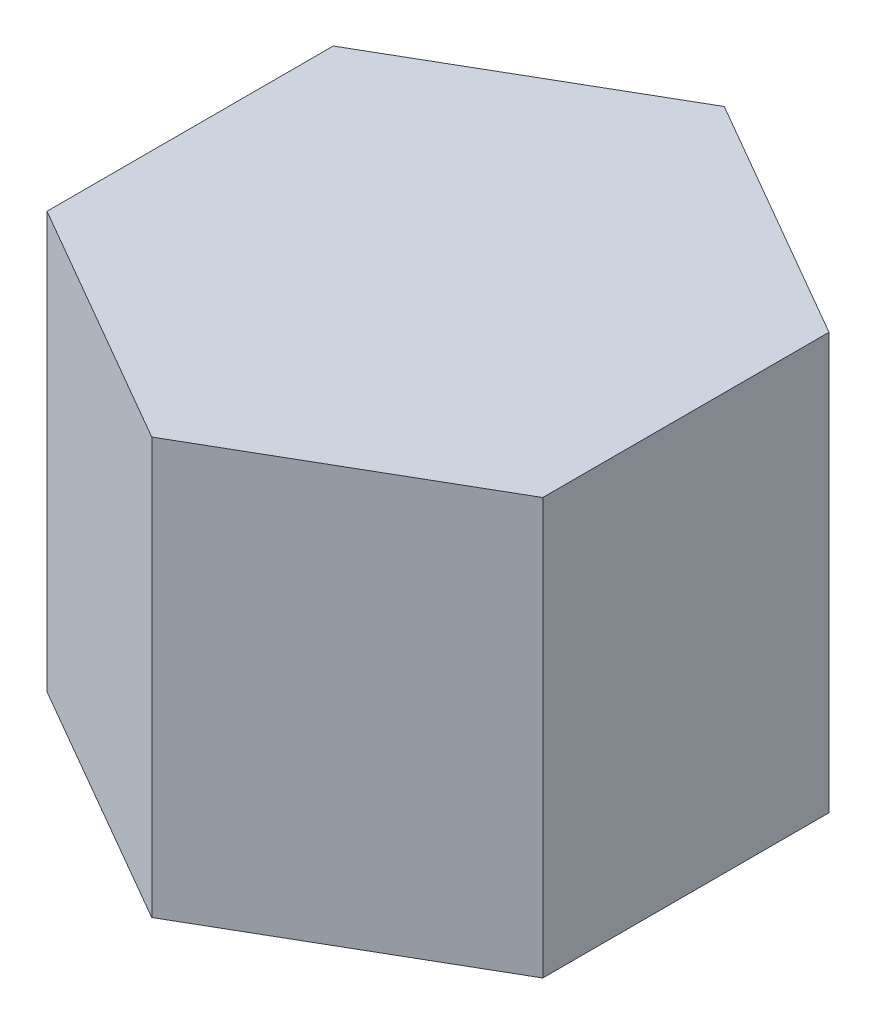
ISO-10303-21;
HEADER;
FILE_DESCRIPTION(('STEP AP214'),'2;1');
FILE_NAME('part.step','',(''),(''),'','','');
FILE_SCHEMA(('AUTOMOTIVE_DESIGN { 1 0 10303 214 1 1 1 1 }'));
ENDSEC;
DATA;
#1=APPLICATION_CONTEXT('core data for automotive mechanical design processes');
#2=APPLICATION_PROTOCOL_DEFINITION('international standard','automotive_design',2000,#1);
#3=PRODUCT_CONTEXT('',#1,'mechanical');
#4=PRODUCT('Part','Part','',(#3));
#5=PRODUCT_RELATED_PRODUCT_CATEGORY('part','',(#4));
#6=PRODUCT_DEFINITION_FORMATION('','',#4);
#7=PRODUCT_DEFINITION_CONTEXT('part definition',#1,'design');
#8=PRODUCT_DEFINITION('design','',#6,#7);
#9=PRODUCT_DEFINITION_SHAPE('','',#8);
#10=(LENGTH_UNIT() NAMED_UNIT(*) SI_UNIT(.MILLI.,.METRE.));
#11=(NAMED_UNIT(*) PLANE_ANGLE_UNIT() SI_UNIT($,.RADIAN.));
#12=(NAMED_UNIT(*) SI_UNIT($,.STERADIAN.) SOLID_ANGLE_UNIT());
#13=UNCERTAINTY_MEASURE_WITH_UNIT(LENGTH_MEASURE(1.E-05),#10,'distance_accuracy_value','');
#14=(GEOMETRIC_REPRESENTATION_CONTEXT(3) GLOBAL_UNCERTAINTY_ASSIGNED_CONTEXT((#13)) GLOBAL_UNIT_ASSIGNED_CONTEXT((#10,
#11,#12)) REPRESENTATION_CONTEXT('',''));
#15=CARTESIAN_POINT('',(0.,0.,0.));
#16=DIRECTION('',(0.,0.,1.));
#17=DIRECTION('',(1.,0.,0.));
#18=AXIS2_PLACEMENT_3D('',#15,#16,#17);
#19=CARTESIAN_POINT('',(205.839551417382,-147.556598747966,294.280047431848));
#20=DIRECTION('',(-0.500000000000096,0.,-0.866025403784383));
#21=DIRECTION('',(-0.866025403784383,0.,0.500000000000096));
#22=AXIS2_PLACEMENT_3D('',#19,#20,#21);
#23=PLANE('',#22);
#24=CARTESIAN_POINT('',(206.142660308706,-147.047793579175,294.105047431848));
#25=DIRECTION('',(-0.866025403784383,0.,0.500000000000096));
#26=VECTOR('',#25,1.);
#27=LINE('',#24,#26);
#28=CARTESIAN_POINT('',(206.142660308706,-147.047793579175,294.105047431848));
#29=VERTEX_POINT('',#28);
#30=CARTESIAN_POINT('',(205.839551417382,-147.047793579175,294.280047431848));
#31=VERTEX_POINT('',#30);
#32=EDGE_CURVE('E170',#29,#31,#27,.T.);
#33=ORIENTED_EDGE('',*,*,#32,.T.);
#34=CARTESIAN_POINT('',(205.839551417382,-147.556598747966,294.280047431848));
#35=DIRECTION('',(0.,1.,0.));
#36=VECTOR('',#35,1.);
#37=LINE('',#34,#36);
#38=CARTESIAN_POINT('',(205.839551417382,-147.556598747966,294.280047431848));
#39=VERTEX_POINT('',#38);
#40=EDGE_CURVE('E35',#39,#31,#37,.T.);
#41=ORIENTED_EDGE('',*,*,#40,.F.);
#42=CARTESIAN_POINT('',(206.142660308706,-147.556598747966,294.105047431848));
#43=DIRECTION('',(-0.866025403784383,0.,0.500000000000096));
#44=VECTOR('',#43,1.);
#45=LINE('',#42,#44);
#46=CARTESIAN_POINT('',(206.142660308706,-147.556598747966,294.105047431848));
#47=VERTEX_POINT('',#46);
#48=EDGE_CURVE('E159',#47,#39,#45,.T.);
#49=ORIENTED_EDGE('',*,*,#48,.F.);
#50=CARTESIAN_POINT('',(206.142660308706,-147.556598747966,294.105047431848));
#51=DIRECTION('',(0.,1.,0.));
#52=VECTOR('',#51,1.);
#53=LINE('',#50,#52);
#54=EDGE_CURVE('E10',#47,#29,#53,.T.);
#55=ORIENTED_EDGE('',*,*,#54,.T.);
#56=EDGE_LOOP('',(#33,#41,#49,#55));
#57=FACE_BOUND('',#56,.T.);
#58=ADVANCED_FACE('F16',(#57),#23,.F.);
#59=CARTESIAN_POINT('',(206.142660308706,-147.556598747966,291.594471220494));
#60=DIRECTION('',(-1.,0.,0.));
#61=DIRECTION('',(0.,-1.,0.));
#62=AXIS2_PLACEMENT_3D('',#59,#60,#61);
#63=PLANE('',#62);
#64=CARTESIAN_POINT('',(206.142660308706,-147.047793579175,293.755047431848));
#65=DIRECTION('',(0.,0.,1.));
#66=VECTOR('',#65,1.);
#67=LINE('',#64,#66);
#68=CARTESIAN_POINT('',(206.142660308706,-147.047793579175,293.755047431848));
#69=VERTEX_POINT('',#68);
#70=EDGE_CURVE('E167',#69,#29,#67,.T.);
#71=ORIENTED_EDGE('',*,*,#70,.T.);
#72=ORIENTED_EDGE('',*,*,#54,.F.);
#73=CARTESIAN_POINT('',(206.142660308706,-147.556598747966,293.755047431848));
#74=DIRECTION('',(0.,0.,1.));
#75=VECTOR('',#74,1.);
#76=LINE('',#73,#75);
#77=CARTESIAN_POINT('',(206.142660308706,-147.556598747966,293.755047431848));
#78=VERTEX_POINT('',#77);
#79=EDGE_CURVE('E156',#78,#47,#76,.T.);
#80=ORIENTED_EDGE('',*,*,#79,.F.);
#81=CARTESIAN_POINT('',(206.142660308706,-147.556598747966,293.755047431848));
#82=DIRECTION('',(0.,1.,0.));
#83=VECTOR('',#82,1.);
#84=LINE('',#81,#83);
#85=EDGE_CURVE('E27',#78,#69,#84,.T.);
#86=ORIENTED_EDGE('',*,*,#85,.T.);
#87=EDGE_LOOP('',(#71,#72,#80,#86));
#88=FACE_BOUND('',#87,.T.);
#89=ADVANCED_FACE('F189',(#88),#63,.F.);
#90=CARTESIAN_POINT('',(206.142660308706,-147.556598747966,293.755047431848));
#91=DIRECTION('',(-0.500000000000096,0.,0.866025403784383));
#92=DIRECTION('',(0.866025403784383,0.,0.500000000000096));
#93=AXIS2_PLACEMENT_3D('',#90,#91,#92);
#94=PLANE('',#93);
#95=CARTESIAN_POINT('',(205.839551417382,-147.047793579175,293.580047431848));
#96=DIRECTION('',(0.866025403784383,0.,0.500000000000096));
#97=VECTOR('',#96,1.);
#98=LINE('',#95,#97);
#99=CARTESIAN_POINT('',(205.839551417382,-147.047793579175,293.580047431848));
#100=VERTEX_POINT('',#99);
#101=EDGE_CURVE('E163',#100,#69,#98,.T.);
#102=ORIENTED_EDGE('',*,*,#101,.T.);
#103=ORIENTED_EDGE('',*,*,#85,.F.);
#104=CARTESIAN_POINT('',(205.839551417382,-147.556598747966,293.580047431848));
#105=DIRECTION('',(0.866025403784383,0.,0.500000000000096));
#106=VECTOR('',#105,1.);
#107=LINE('',#104,#106);
#108=CARTESIAN_POINT('',(205.839551417382,-147.556598747966,293.580047431848));
#109=VERTEX_POINT('',#108);
#110=EDGE_CURVE('E106',#109,#78,#107,.T.);
#111=ORIENTED_EDGE('',*,*,#110,.F.);
#112=CARTESIAN_POINT('',(205.839551417382,-147.556598747966,293.580047431848));
#113=DIRECTION('',(0.,1.,0.));
#114=VECTOR('',#113,1.);
#115=LINE('',#112,#114);
#116=EDGE_CURVE('E94',#109,#100,#115,.T.);
#117=ORIENTED_EDGE('',*,*,#116,.T.);
#118=EDGE_LOOP('',(#102,#103,#111,#117));
#119=FACE_BOUND('',#118,.T.);
#120=ADVANCED_FACE('F198',(#119),#94,.F.);
#121=CARTESIAN_POINT('',(205.839551417382,-147.556598747966,293.580047431848));
#122=DIRECTION('',(0.500000000000096,0.,0.866025403784383));
#123=DIRECTION('',(0.866025403784383,0.,-0.500000000000096));
#124=AXIS2_PLACEMENT_3D('',#121,#122,#123);
#125=PLANE('',#124);
#126=CARTESIAN_POINT('',(205.536442526057,-147.047793579175,293.755047431848));
#127=DIRECTION('',(0.866025403784383,0.,-0.500000000000096));
#128=VECTOR('',#127,1.);
#129=LINE('',#126,#128);
#130=CARTESIAN_POINT('',(205.536442526057,-147.047793579175,293.755047431848));
#131=VERTEX_POINT('',#130);
#132=EDGE_CURVE('E162',#131,#100,#129,.T.);
#133=ORIENTED_EDGE('',*,*,#132,.T.);
#134=ORIENTED_EDGE('',*,*,#116,.F.);
#135=CARTESIAN_POINT('',(205.536442526057,-147.556598747966,293.755047431848));
#136=DIRECTION('',(0.866025403784383,0.,-0.500000000000096));
#137=VECTOR('',#136,1.);
#138=LINE('',#135,#137);
#139=CARTESIAN_POINT('',(205.536442526057,-147.556598747966,293.755047431848));
#140=VERTEX_POINT('',#139);
#141=EDGE_CURVE('E98',#140,#109,#138,.T.);
#142=ORIENTED_EDGE('',*,*,#141,.F.);
#143=CARTESIAN_POINT('',(205.536442526057,-147.556598747966,293.755047431848));
#144=DIRECTION('',(0.,1.,0.));
#145=VECTOR('',#144,1.);
#146=LINE('',#143,#145);
#147=EDGE_CURVE('E79',#140,#131,#146,.T.);
#148=ORIENTED_EDGE('',*,*,#147,.T.);
#149=EDGE_LOOP('',(#133,#134,#142,#148));
#150=FACE_BOUND('',#149,.T.);
#151=ADVANCED_FACE('F100',(#150),#125,.F.);
#152=CARTESIAN_POINT('',(205.536442526057,-147.556598747966,291.594471220494));
#153=DIRECTION('',(1.,0.,0.));
#154=DIRECTION('',(0.,1.,0.));
#155=AXIS2_PLACEMENT_3D('',#152,#153,#154);
#156=PLANE('',#155);
#157=CARTESIAN_POINT('',(205.536442526057,-147.047793579175,294.105047431848));
#158=DIRECTION('',(0.,0.,-1.));
#159=VECTOR('',#158,1.);
#160=LINE('',#157,#159);
#161=CARTESIAN_POINT('',(205.536442526057,-147.047793579175,294.105047431848));
#162=VERTEX_POINT('',#161);
#163=EDGE_CURVE('E88',#162,#131,#160,.T.);
#164=ORIENTED_EDGE('',*,*,#163,.T.);
#165=ORIENTED_EDGE('',*,*,#147,.F.);
#166=CARTESIAN_POINT('',(205.536442526057,-147.556598747966,294.105047431848));
#167=DIRECTION('',(0.,0.,-1.));
#168=VECTOR('',#167,1.);
#169=LINE('',#166,#168);
#170=CARTESIAN_POINT('',(205.536442526057,-147.556598747966,294.105047431848));
#171=VERTEX_POINT('',#170);
#172=EDGE_CURVE('E84',#171,#140,#169,.T.);
#173=ORIENTED_EDGE('',*,*,#172,.F.);
#174=CARTESIAN_POINT('',(205.536442526057,-147.556598747966,294.105047431848));
#175=DIRECTION('',(0.,1.,0.));
#176=VECTOR('',#175,1.);
#177=LINE('',#174,#176);
#178=EDGE_CURVE('E58',#171,#162,#177,.T.);
#179=ORIENTED_EDGE('',*,*,#178,.T.);
#180=EDGE_LOOP('',(#164,#165,#173,#179));
#181=FACE_BOUND('',#180,.T.);
#182=ADVANCED_FACE('F82',(#181),#156,.F.);
#183=CARTESIAN_POINT('',(205.536442526057,-147.556598747966,294.105047431848));
#184=DIRECTION('',(0.500000000000062,0.,-0.866025403784403));
#185=DIRECTION('',(-0.866025403784403,0.,-0.500000000000062));
#186=AXIS2_PLACEMENT_3D('',#183,#184,#185);
#187=PLANE('',#186);
#188=CARTESIAN_POINT('',(205.839551417382,-147.047793579175,294.280047431848));
#189=DIRECTION('',(-0.866025403784403,0.,-0.500000000000062));
#190=VECTOR('',#189,1.);
#191=LINE('',#188,#190);
#192=EDGE_CURVE('E160',#31,#162,#191,.T.);
#193=ORIENTED_EDGE('',*,*,#192,.T.);
#194=ORIENTED_EDGE('',*,*,#178,.F.);
#195=CARTESIAN_POINT('',(205.839551417382,-147.556598747966,294.280047431848));
#196=DIRECTION('',(-0.866025403784403,0.,-0.500000000000062));
#197=VECTOR('',#196,1.);
#198=LINE('',#195,#197);
#199=EDGE_CURVE('E112',#39,#171,#198,.T.);
#200=ORIENTED_EDGE('',*,*,#199,.F.);
#201=ORIENTED_EDGE('',*,*,#40,.T.);
#202=EDGE_LOOP('',(#193,#194,#200,#201));
#203=FACE_BOUND('',#202,.T.);
#204=ADVANCED_FACE('F131',(#203),#187,.F.);
#205=CARTESIAN_POINT('',(206.491105863044,-147.556598747966,291.594471220494));
#206=DIRECTION('',(0.,1.,0.));
#207=DIRECTION('',(-1.,0.,0.));
#208=AXIS2_PLACEMENT_3D('',#205,#206,#207);
#209=PLANE('',#208);
#210=ORIENTED_EDGE('',*,*,#48,.T.);
#211=ORIENTED_EDGE('',*,*,#199,.T.);
#212=ORIENTED_EDGE('',*,*,#172,.T.);
#213=ORIENTED_EDGE('',*,*,#141,.T.);
#214=ORIENTED_EDGE('',*,*,#110,.T.);
#215=ORIENTED_EDGE('',*,*,#79,.T.);
#216=EDGE_LOOP('',(#210,#211,#212,#213,#214,#215));
#217=FACE_BOUND('',#216,.T.);
#218=ADVANCED_FACE('F111',(#217),#209,.F.);
#219=CARTESIAN_POINT('',(206.491105863044,-147.047793579175,291.594471220494));
#220=DIRECTION('',(0.,1.,0.));
#221=DIRECTION('',(-1.,0.,0.));
#222=AXIS2_PLACEMENT_3D('',#219,#220,#221);
#223=PLANE('',#222);
#224=ORIENTED_EDGE('',*,*,#32,.F.);
#225=ORIENTED_EDGE('',*,*,#70,.F.);
#226=ORIENTED_EDGE('',*,*,#101,.F.);
#227=ORIENTED_EDGE('',*,*,#132,.F.);
#228=ORIENTED_EDGE('',*,*,#163,.F.);
#229=ORIENTED_EDGE('',*,*,#192,.F.);
#230=EDGE_LOOP('',(#224,#225,#226,#227,#228,#229));
#231=FACE_BOUND('',#230,.T.);
#232=ADVANCED_FACE('F130',(#231),#223,.T.);
#233=CLOSED_SHELL('',(#58,#89,#120,#151,#182,#204,#218,#232));
#234=MANIFOLD_SOLID_BREP('B1',#233);
#235=ADVANCED_BREP_SHAPE_REPRESENTATION('',(#18,#234),#14);
#236=SHAPE_DEFINITION_REPRESENTATION(#9,#235);
ENDSEC;
END-ISO-10303-21;
